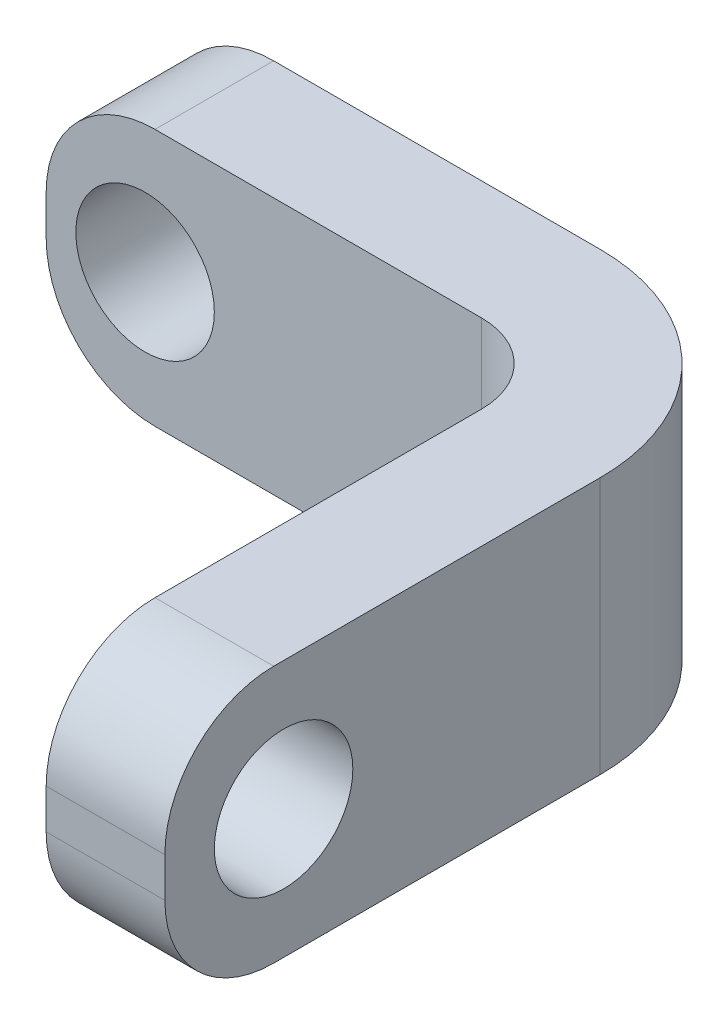
ISO-10303-21;
HEADER;
FILE_DESCRIPTION(('STEP AP214'),'2;1');
FILE_NAME('part.step','',(''),(''),'','','');
FILE_SCHEMA(('AUTOMOTIVE_DESIGN { 1 0 10303 214 1 1 1 1 }'));
ENDSEC;
DATA;
#1=APPLICATION_CONTEXT('core data for automotive mechanical design processes');
#2=APPLICATION_PROTOCOL_DEFINITION('international standard','automotive_design',2000,#1);
#3=PRODUCT_CONTEXT('',#1,'mechanical');
#4=PRODUCT('Part','Part','',(#3));
#5=PRODUCT_RELATED_PRODUCT_CATEGORY('part','',(#4));
#6=PRODUCT_DEFINITION_FORMATION('','',#4);
#7=PRODUCT_DEFINITION_CONTEXT('part definition',#1,'design');
#8=PRODUCT_DEFINITION('design','',#6,#7);
#9=PRODUCT_DEFINITION_SHAPE('','',#8);
#10=(LENGTH_UNIT() NAMED_UNIT(*) SI_UNIT(.MILLI.,.METRE.));
#11=(NAMED_UNIT(*) PLANE_ANGLE_UNIT() SI_UNIT($,.RADIAN.));
#12=(NAMED_UNIT(*) SI_UNIT($,.STERADIAN.) SOLID_ANGLE_UNIT());
#13=UNCERTAINTY_MEASURE_WITH_UNIT(LENGTH_MEASURE(1.E-05),#10,'distance_accuracy_value','');
#14=(GEOMETRIC_REPRESENTATION_CONTEXT(3) GLOBAL_UNCERTAINTY_ASSIGNED_CONTEXT((#13)) GLOBAL_UNIT_ASSIGNED_CONTEXT((#10,
#11,#12)) REPRESENTATION_CONTEXT('',''));
#15=CARTESIAN_POINT('',(0.,0.,0.));
#16=DIRECTION('',(0.,0.,1.));
#17=DIRECTION('',(1.,0.,0.));
#18=AXIS2_PLACEMENT_3D('',#15,#16,#17);
#19=CARTESIAN_POINT('',(-8.,0.,3.));
#20=DIRECTION('',(1.,0.,0.));
#21=DIRECTION('',(0.,0.,-1.));
#22=AXIS2_PLACEMENT_3D('',#19,#20,#21);
#23=PLANE('',#22);
#24=DIRECTION('',(0.,-1.,0.));
#25=VECTOR('',#24,1.);
#26=CARTESIAN_POINT('',(-8.,0.,0.));
#27=LINE('',#26,#25);
#28=CARTESIAN_POINT('',(-8.,0.5,0.));
#29=VERTEX_POINT('',#28);
#30=CARTESIAN_POINT('',(-8.,-0.5,0.));
#31=VERTEX_POINT('',#30);
#32=EDGE_CURVE('E244',#29,#31,#27,.T.);
#33=ORIENTED_EDGE('',*,*,#32,.T.);
#34=DIRECTION('',(0.,0.,-1.));
#35=VECTOR('',#34,1.);
#36=CARTESIAN_POINT('',(-8.,-0.5,3.));
#37=LINE('',#36,#35);
#38=CARTESIAN_POINT('',(-8.,-0.5,3.));
#39=VERTEX_POINT('',#38);
#40=EDGE_CURVE('E203',#31,#39,#37,.F.);
#41=ORIENTED_EDGE('',*,*,#40,.T.);
#42=DIRECTION('',(0.,-1.,0.));
#43=VECTOR('',#42,1.);
#44=CARTESIAN_POINT('',(-8.,0.,3.));
#45=LINE('',#44,#43);
#46=CARTESIAN_POINT('',(-8.,0.5,3.));
#47=VERTEX_POINT('',#46);
#48=EDGE_CURVE('E258',#47,#39,#45,.T.);
#49=ORIENTED_EDGE('',*,*,#48,.F.);
#50=DIRECTION('',(0.,0.,-1.));
#51=VECTOR('',#50,1.);
#52=CARTESIAN_POINT('',(-8.,0.5,0.));
#53=LINE('',#52,#51);
#54=EDGE_CURVE('E199',#47,#29,#53,.T.);
#55=ORIENTED_EDGE('',*,*,#54,.T.);
#56=EDGE_LOOP('',(#33,#41,#49,#55));
#57=FACE_BOUND('',#56,.T.);
#58=ADVANCED_FACE('F45',(#57),#23,.F.);
#59=CARTESIAN_POINT('',(0.,-3.25,3.));
#60=DIRECTION('',(0.,1.,0.));
#61=DIRECTION('',(-1.,0.,0.));
#62=AXIS2_PLACEMENT_3D('',#59,#60,#61);
#63=PLANE('',#62);
#64=DIRECTION('',(1.,0.,0.));
#65=VECTOR('',#64,1.);
#66=CARTESIAN_POINT('',(0.,-3.25,0.));
#67=LINE('',#66,#65);
#68=CARTESIAN_POINT('',(-5.25,-3.25,0.));
#69=VERTEX_POINT('',#68);
#70=CARTESIAN_POINT('',(3.,-3.25,0.));
#71=VERTEX_POINT('',#70);
#72=EDGE_CURVE('E236',#69,#71,#67,.T.);
#73=ORIENTED_EDGE('',*,*,#72,.T.);
#74=CARTESIAN_POINT('',(3.,-3.25,5.));
#75=DIRECTION('',(0.,1.,0.));
#76=DIRECTION('',(-1.,0.,0.));
#77=AXIS2_PLACEMENT_3D('',#74,#75,#76);
#78=CIRCLE('',#77,5.);
#79=CARTESIAN_POINT('',(8.,-3.25,5.));
#80=VERTEX_POINT('',#79);
#81=EDGE_CURVE('E68',#71,#80,#78,.F.);
#82=ORIENTED_EDGE('',*,*,#81,.T.);
#83=DIRECTION('',(0.,0.,-1.));
#84=VECTOR('',#83,1.);
#85=CARTESIAN_POINT('',(8.,-3.25,16.));
#86=LINE('',#85,#84);
#87=CARTESIAN_POINT('',(8.,-3.25,13.25));
#88=VERTEX_POINT('',#87);
#89=EDGE_CURVE('E275',#88,#80,#86,.T.);
#90=ORIENTED_EDGE('',*,*,#89,.F.);
#91=DIRECTION('',(1.,0.,0.));
#92=VECTOR('',#91,1.);
#93=CARTESIAN_POINT('',(5.,-3.25,13.25));
#94=LINE('',#93,#92);
#95=CARTESIAN_POINT('',(5.,-3.25,13.25));
#96=VERTEX_POINT('',#95);
#97=EDGE_CURVE('E179',#88,#96,#94,.F.);
#98=ORIENTED_EDGE('',*,*,#97,.T.);
#99=DIRECTION('',(0.,0.,-1.));
#100=VECTOR('',#99,1.);
#101=CARTESIAN_POINT('',(5.,-3.25,16.));
#102=LINE('',#101,#100);
#103=CARTESIAN_POINT('',(5.,-3.25,5.));
#104=VERTEX_POINT('',#103);
#105=EDGE_CURVE('E271',#96,#104,#102,.T.);
#106=ORIENTED_EDGE('',*,*,#105,.T.);
#107=CARTESIAN_POINT('',(3.,-3.25,5.));
#108=DIRECTION('',(0.,1.,0.));
#109=DIRECTION('',(-1.,0.,0.));
#110=AXIS2_PLACEMENT_3D('',#107,#108,#109);
#111=CIRCLE('',#110,2.);
#112=CARTESIAN_POINT('',(3.,-3.25,3.));
#113=VERTEX_POINT('',#112);
#114=EDGE_CURVE('E219',#104,#113,#111,.T.);
#115=ORIENTED_EDGE('',*,*,#114,.T.);
#116=DIRECTION('',(1.,0.,0.));
#117=VECTOR('',#116,1.);
#118=CARTESIAN_POINT('',(0.,-3.25,3.));
#119=LINE('',#118,#117);
#120=CARTESIAN_POINT('',(-5.25,-3.25,3.));
#121=VERTEX_POINT('',#120);
#122=EDGE_CURVE('E167',#121,#113,#119,.T.);
#123=ORIENTED_EDGE('',*,*,#122,.F.);
#124=DIRECTION('',(0.,0.,-1.));
#125=VECTOR('',#124,1.);
#126=CARTESIAN_POINT('',(-5.25,-3.25,3.));
#127=LINE('',#126,#125);
#128=EDGE_CURVE('E175',#121,#69,#127,.T.);
#129=ORIENTED_EDGE('',*,*,#128,.T.);
#130=EDGE_LOOP('',(#73,#82,#90,#98,#106,#115,#123,#129));
#131=FACE_BOUND('',#130,.T.);
#132=ADVANCED_FACE('F240',(#131),#63,.F.);
#133=CARTESIAN_POINT('',(-5.5,0.,3.));
#134=DIRECTION('',(0.,0.,-1.));
#135=DIRECTION('',(-1.,0.,0.));
#136=AXIS2_PLACEMENT_3D('',#133,#134,#135);
#137=CYLINDRICAL_SURFACE('',#136,1.75);
#138=CARTESIAN_POINT('',(-5.5,0.,3.));
#139=DIRECTION('',(0.,0.,1.));
#140=DIRECTION('',(1.,0.,0.));
#141=AXIS2_PLACEMENT_3D('',#138,#139,#140);
#142=CIRCLE('',#141,1.75);
#143=CARTESIAN_POINT('',(-3.75,0.,3.));
#144=VERTEX_POINT('',#143);
#145=EDGE_CURVE('E247',#144,#144,#142,.T.);
#146=ORIENTED_EDGE('',*,*,#145,.T.);
#147=EDGE_LOOP('',(#146));
#148=FACE_BOUND('',#147,.T.);
#149=CARTESIAN_POINT('',(-5.5,0.,0.));
#150=DIRECTION('',(0.,0.,1.));
#151=DIRECTION('',(1.,0.,0.));
#152=AXIS2_PLACEMENT_3D('',#149,#150,#151);
#153=CIRCLE('',#152,1.75);
#154=CARTESIAN_POINT('',(-3.75,0.,0.));
#155=VERTEX_POINT('',#154);
#156=EDGE_CURVE('E249',#155,#155,#153,.T.);
#157=ORIENTED_EDGE('',*,*,#156,.F.);
#158=EDGE_LOOP('',(#157));
#159=FACE_BOUND('',#158,.T.);
#160=ADVANCED_FACE('F308',(#148,#159),#137,.F.);
#161=CARTESIAN_POINT('',(0.,3.25,3.));
#162=DIRECTION('',(0.,1.,0.));
#163=DIRECTION('',(-1.,0.,0.));
#164=AXIS2_PLACEMENT_3D('',#161,#162,#163);
#165=PLANE('',#164);
#166=DIRECTION('',(0.,0.,-1.));
#167=VECTOR('',#166,1.);
#168=CARTESIAN_POINT('',(8.,3.25,16.));
#169=LINE('',#168,#167);
#170=CARTESIAN_POINT('',(8.,3.25,13.25));
#171=VERTEX_POINT('',#170);
#172=CARTESIAN_POINT('',(8.,3.25,5.));
#173=VERTEX_POINT('',#172);
#174=EDGE_CURVE('E137',#171,#173,#169,.T.);
#175=ORIENTED_EDGE('',*,*,#174,.T.);
#176=CARTESIAN_POINT('',(3.,3.25,5.));
#177=DIRECTION('',(0.,1.,0.));
#178=DIRECTION('',(-1.,0.,0.));
#179=AXIS2_PLACEMENT_3D('',#176,#177,#178);
#180=CIRCLE('',#179,5.);
#181=CARTESIAN_POINT('',(3.,3.25,0.));
#182=VERTEX_POINT('',#181);
#183=EDGE_CURVE('E11',#173,#182,#180,.T.);
#184=ORIENTED_EDGE('',*,*,#183,.T.);
#185=DIRECTION('',(1.,0.,0.));
#186=VECTOR('',#185,1.);
#187=CARTESIAN_POINT('',(0.,3.25,0.));
#188=LINE('',#187,#186);
#189=CARTESIAN_POINT('',(-5.25,3.25,0.));
#190=VERTEX_POINT('',#189);
#191=EDGE_CURVE('E170',#190,#182,#188,.T.);
#192=ORIENTED_EDGE('',*,*,#191,.F.);
#193=DIRECTION('',(0.,0.,-1.));
#194=VECTOR('',#193,1.);
#195=CARTESIAN_POINT('',(-5.25,3.25,3.));
#196=LINE('',#195,#194);
#197=CARTESIAN_POINT('',(-5.25,3.25,3.));
#198=VERTEX_POINT('',#197);
#199=EDGE_CURVE('E187',#190,#198,#196,.F.);
#200=ORIENTED_EDGE('',*,*,#199,.T.);
#201=DIRECTION('',(1.,0.,0.));
#202=VECTOR('',#201,1.);
#203=CARTESIAN_POINT('',(0.,3.25,3.));
#204=LINE('',#203,#202);
#205=CARTESIAN_POINT('',(3.,3.25,3.));
#206=VERTEX_POINT('',#205);
#207=EDGE_CURVE('E161',#198,#206,#204,.T.);
#208=ORIENTED_EDGE('',*,*,#207,.T.);
#209=CARTESIAN_POINT('',(3.,3.25,5.));
#210=DIRECTION('',(0.,1.,0.));
#211=DIRECTION('',(-1.,0.,0.));
#212=AXIS2_PLACEMENT_3D('',#209,#210,#211);
#213=CIRCLE('',#212,2.);
#214=CARTESIAN_POINT('',(5.,3.25,5.));
#215=VERTEX_POINT('',#214);
#216=EDGE_CURVE('E222',#206,#215,#213,.F.);
#217=ORIENTED_EDGE('',*,*,#216,.T.);
#218=DIRECTION('',(0.,0.,-1.));
#219=VECTOR('',#218,1.);
#220=CARTESIAN_POINT('',(5.,3.25,16.));
#221=LINE('',#220,#219);
#222=CARTESIAN_POINT('',(5.,3.25,13.25));
#223=VERTEX_POINT('',#222);
#224=EDGE_CURVE('E267',#223,#215,#221,.T.);
#225=ORIENTED_EDGE('',*,*,#224,.F.);
#226=DIRECTION('',(1.,0.,0.));
#227=VECTOR('',#226,1.);
#228=CARTESIAN_POINT('',(0.,3.25,13.25));
#229=LINE('',#228,#227);
#230=EDGE_CURVE('E190',#223,#171,#229,.T.);
#231=ORIENTED_EDGE('',*,*,#230,.T.);
#232=EDGE_LOOP('',(#175,#184,#192,#200,#208,#217,#225,#231));
#233=FACE_BOUND('',#232,.T.);
#234=ADVANCED_FACE('F314',(#233),#165,.T.);
#235=CARTESIAN_POINT('',(0.,0.,3.));
#236=DIRECTION('',(0.,0.,1.));
#237=DIRECTION('',(1.,0.,0.));
#238=AXIS2_PLACEMENT_3D('',#235,#236,#237);
#239=PLANE('',#238);
#240=ORIENTED_EDGE('',*,*,#145,.F.);
#241=EDGE_LOOP('',(#240));
#242=FACE_BOUND('',#241,.T.);
#243=ORIENTED_EDGE('',*,*,#122,.T.);
#244=DIRECTION('',(0.,-1.,0.));
#245=VECTOR('',#244,1.);
#246=CARTESIAN_POINT('',(3.,0.,3.));
#247=LINE('',#246,#245);
#248=EDGE_CURVE('E216',#113,#206,#247,.F.);
#249=ORIENTED_EDGE('',*,*,#248,.T.);
#250=ORIENTED_EDGE('',*,*,#207,.F.);
#251=CARTESIAN_POINT('',(-5.25,0.5,3.));
#252=DIRECTION('',(0.,0.,1.));
#253=DIRECTION('',(1.,0.,0.));
#254=AXIS2_PLACEMENT_3D('',#251,#252,#253);
#255=CIRCLE('',#254,2.75);
#256=EDGE_CURVE('E206',#198,#47,#255,.T.);
#257=ORIENTED_EDGE('',*,*,#256,.T.);
#258=ORIENTED_EDGE('',*,*,#48,.T.);
#259=CARTESIAN_POINT('',(-5.25,-0.5,3.));
#260=DIRECTION('',(0.,0.,1.));
#261=DIRECTION('',(1.,0.,0.));
#262=AXIS2_PLACEMENT_3D('',#259,#260,#261);
#263=CIRCLE('',#262,2.75);
#264=EDGE_CURVE('E209',#39,#121,#263,.T.);
#265=ORIENTED_EDGE('',*,*,#264,.T.);
#266=EDGE_LOOP('',(#243,#249,#250,#257,#258,#265));
#267=FACE_BOUND('',#266,.T.);
#268=ADVANCED_FACE('F346',(#242,#267),#239,.T.);
#269=CARTESIAN_POINT('',(0.,0.,0.));
#270=DIRECTION('',(0.,0.,1.));
#271=DIRECTION('',(1.,0.,0.));
#272=AXIS2_PLACEMENT_3D('',#269,#270,#271);
#273=PLANE('',#272);
#274=ORIENTED_EDGE('',*,*,#156,.T.);
#275=EDGE_LOOP('',(#274));
#276=FACE_BOUND('',#275,.T.);
#277=ORIENTED_EDGE('',*,*,#191,.T.);
#278=DIRECTION('',(0.,-1.,0.));
#279=VECTOR('',#278,1.);
#280=CARTESIAN_POINT('',(3.,-3.25,0.));
#281=LINE('',#280,#279);
#282=EDGE_CURVE('E225',#182,#71,#281,.T.);
#283=ORIENTED_EDGE('',*,*,#282,.T.);
#284=ORIENTED_EDGE('',*,*,#72,.F.);
#285=CARTESIAN_POINT('',(-5.25,-0.5,0.));
#286=DIRECTION('',(0.,0.,1.));
#287=DIRECTION('',(1.,0.,0.));
#288=AXIS2_PLACEMENT_3D('',#285,#286,#287);
#289=CIRCLE('',#288,2.75);
#290=EDGE_CURVE('E196',#69,#31,#289,.F.);
#291=ORIENTED_EDGE('',*,*,#290,.T.);
#292=ORIENTED_EDGE('',*,*,#32,.F.);
#293=CARTESIAN_POINT('',(-5.25,0.5,0.));
#294=DIRECTION('',(0.,0.,1.));
#295=DIRECTION('',(1.,0.,0.));
#296=AXIS2_PLACEMENT_3D('',#293,#294,#295);
#297=CIRCLE('',#296,2.75);
#298=EDGE_CURVE('E193',#29,#190,#297,.F.);
#299=ORIENTED_EDGE('',*,*,#298,.T.);
#300=EDGE_LOOP('',(#277,#283,#284,#291,#292,#299));
#301=FACE_BOUND('',#300,.T.);
#302=ADVANCED_FACE('F235',(#276,#301),#273,.F.);
#303=CARTESIAN_POINT('',(5.,0.,16.));
#304=DIRECTION('',(1.,0.,0.));
#305=DIRECTION('',(0.,0.,-1.));
#306=AXIS2_PLACEMENT_3D('',#303,#304,#305);
#307=PLANE('',#306);
#308=CARTESIAN_POINT('',(5.,0.,13.));
#309=DIRECTION('',(1.,0.,0.));
#310=DIRECTION('',(0.,0.,-1.));
#311=AXIS2_PLACEMENT_3D('',#308,#309,#310);
#312=CIRCLE('',#311,1.75);
#313=CARTESIAN_POINT('',(5.,0.,11.25));
#314=VERTEX_POINT('',#313);
#315=EDGE_CURVE('E155',#314,#314,#312,.F.);
#316=ORIENTED_EDGE('',*,*,#315,.F.);
#317=EDGE_LOOP('',(#316));
#318=FACE_BOUND('',#317,.T.);
#319=ORIENTED_EDGE('',*,*,#224,.T.);
#320=DIRECTION('',(0.,-1.,0.));
#321=VECTOR('',#320,1.);
#322=CARTESIAN_POINT('',(5.,0.,5.));
#323=LINE('',#322,#321);
#324=EDGE_CURVE('E212',#215,#104,#323,.T.);
#325=ORIENTED_EDGE('',*,*,#324,.T.);
#326=ORIENTED_EDGE('',*,*,#105,.F.);
#327=CARTESIAN_POINT('',(5.,-0.499999999999999,13.25));
#328=DIRECTION('',(1.,0.,0.));
#329=DIRECTION('',(0.,0.,-1.));
#330=AXIS2_PLACEMENT_3D('',#327,#328,#329);
#331=CIRCLE('',#330,2.75);
#332=CARTESIAN_POINT('',(5.,-0.499999999999999,16.));
#333=VERTEX_POINT('',#332);
#334=EDGE_CURVE('E184',#96,#333,#331,.F.);
#335=ORIENTED_EDGE('',*,*,#334,.T.);
#336=DIRECTION('',(0.,-1.,0.));
#337=VECTOR('',#336,1.);
#338=CARTESIAN_POINT('',(5.,0.,16.));
#339=LINE('',#338,#337);
#340=CARTESIAN_POINT('',(5.,0.499999999999999,16.));
#341=VERTEX_POINT('',#340);
#342=EDGE_CURVE('E154',#341,#333,#339,.T.);
#343=ORIENTED_EDGE('',*,*,#342,.F.);
#344=CARTESIAN_POINT('',(5.,0.499999999999999,13.25));
#345=DIRECTION('',(1.,0.,0.));
#346=DIRECTION('',(0.,0.,-1.));
#347=AXIS2_PLACEMENT_3D('',#344,#345,#346);
#348=CIRCLE('',#347,2.75);
#349=EDGE_CURVE('E159',#341,#223,#348,.F.);
#350=ORIENTED_EDGE('',*,*,#349,.T.);
#351=EDGE_LOOP('',(#319,#325,#326,#335,#343,#350));
#352=FACE_BOUND('',#351,.T.);
#353=ADVANCED_FACE('F292',(#318,#352),#307,.F.);
#354=CARTESIAN_POINT('',(8.,0.,16.));
#355=DIRECTION('',(1.,0.,0.));
#356=DIRECTION('',(0.,0.,-1.));
#357=AXIS2_PLACEMENT_3D('',#354,#355,#356);
#358=PLANE('',#357);
#359=CARTESIAN_POINT('',(8.,0.,13.));
#360=DIRECTION('',(1.,0.,0.));
#361=DIRECTION('',(0.,0.,-1.));
#362=AXIS2_PLACEMENT_3D('',#359,#360,#361);
#363=CIRCLE('',#362,1.75);
#364=CARTESIAN_POINT('',(8.,0.,11.25));
#365=VERTEX_POINT('',#364);
#366=EDGE_CURVE('E283',#365,#365,#363,.T.);
#367=ORIENTED_EDGE('',*,*,#366,.F.);
#368=EDGE_LOOP('',(#367));
#369=FACE_BOUND('',#368,.T.);
#370=ORIENTED_EDGE('',*,*,#89,.T.);
#371=DIRECTION('',(0.,-1.,0.));
#372=VECTOR('',#371,1.);
#373=CARTESIAN_POINT('',(8.,3.25,5.));
#374=LINE('',#373,#372);
#375=EDGE_CURVE('E54',#80,#173,#374,.F.);
#376=ORIENTED_EDGE('',*,*,#375,.T.);
#377=ORIENTED_EDGE('',*,*,#174,.F.);
#378=CARTESIAN_POINT('',(8.,0.499999999999999,13.25));
#379=DIRECTION('',(1.,0.,0.));
#380=DIRECTION('',(0.,0.,-1.));
#381=AXIS2_PLACEMENT_3D('',#378,#379,#380);
#382=CIRCLE('',#381,2.75);
#383=CARTESIAN_POINT('',(8.,0.499999999999999,16.));
#384=VERTEX_POINT('',#383);
#385=EDGE_CURVE('E133',#171,#384,#382,.T.);
#386=ORIENTED_EDGE('',*,*,#385,.T.);
#387=DIRECTION('',(0.,-1.,0.));
#388=VECTOR('',#387,1.);
#389=CARTESIAN_POINT('',(8.,0.,16.));
#390=LINE('',#389,#388);
#391=CARTESIAN_POINT('',(8.,-0.499999999999999,16.));
#392=VERTEX_POINT('',#391);
#393=EDGE_CURVE('E136',#384,#392,#390,.T.);
#394=ORIENTED_EDGE('',*,*,#393,.T.);
#395=CARTESIAN_POINT('',(8.,-0.499999999999999,13.25));
#396=DIRECTION('',(1.,0.,0.));
#397=DIRECTION('',(0.,0.,-1.));
#398=AXIS2_PLACEMENT_3D('',#395,#396,#397);
#399=CIRCLE('',#398,2.75);
#400=EDGE_CURVE('E143',#392,#88,#399,.T.);
#401=ORIENTED_EDGE('',*,*,#400,.T.);
#402=EDGE_LOOP('',(#370,#376,#377,#386,#394,#401));
#403=FACE_BOUND('',#402,.T.);
#404=ADVANCED_FACE('F135',(#369,#403),#358,.T.);
#405=CARTESIAN_POINT('',(0.,0.,16.));
#406=DIRECTION('',(0.,0.,1.));
#407=DIRECTION('',(1.,0.,0.));
#408=AXIS2_PLACEMENT_3D('',#405,#406,#407);
#409=PLANE('',#408);
#410=ORIENTED_EDGE('',*,*,#342,.T.);
#411=DIRECTION('',(1.,0.,0.));
#412=VECTOR('',#411,1.);
#413=CARTESIAN_POINT('',(8.,-0.499999999999999,16.));
#414=LINE('',#413,#412);
#415=EDGE_CURVE('E144',#333,#392,#414,.T.);
#416=ORIENTED_EDGE('',*,*,#415,.T.);
#417=ORIENTED_EDGE('',*,*,#393,.F.);
#418=DIRECTION('',(1.,0.,0.));
#419=VECTOR('',#418,1.);
#420=CARTESIAN_POINT('',(0.,0.5,16.));
#421=LINE('',#420,#419);
#422=EDGE_CURVE('E150',#384,#341,#421,.F.);
#423=ORIENTED_EDGE('',*,*,#422,.T.);
#424=EDGE_LOOP('',(#410,#416,#417,#423));
#425=FACE_BOUND('',#424,.T.);
#426=ADVANCED_FACE('F149',(#425),#409,.T.);
#427=CARTESIAN_POINT('',(-8.001,0.,13.));
#428=DIRECTION('',(1.,0.,0.));
#429=DIRECTION('',(0.,0.,-1.));
#430=AXIS2_PLACEMENT_3D('',#427,#428,#429);
#431=CYLINDRICAL_SURFACE('',#430,1.75);
#432=ORIENTED_EDGE('',*,*,#366,.T.);
#433=EDGE_LOOP('',(#432));
#434=FACE_BOUND('',#433,.T.);
#435=ORIENTED_EDGE('',*,*,#315,.T.);
#436=EDGE_LOOP('',(#435));
#437=FACE_BOUND('',#436,.T.);
#438=ADVANCED_FACE('F288',(#434,#437),#431,.F.);
#439=CARTESIAN_POINT('',(0.,-0.5,13.25));
#440=DIRECTION('',(-1.,0.,0.));
#441=DIRECTION('',(0.,-1.,0.));
#442=AXIS2_PLACEMENT_3D('',#439,#440,#441);
#443=CYLINDRICAL_SURFACE('',#442,2.75);
#444=ORIENTED_EDGE('',*,*,#334,.F.);
#445=ORIENTED_EDGE('',*,*,#97,.F.);
#446=ORIENTED_EDGE('',*,*,#400,.F.);
#447=ORIENTED_EDGE('',*,*,#415,.F.);
#448=EDGE_LOOP('',(#444,#445,#446,#447));
#449=FACE_BOUND('',#448,.T.);
#450=ADVANCED_FACE('F316',(#449),#443,.T.);
#451=CARTESIAN_POINT('',(0.,0.5,13.25));
#452=DIRECTION('',(1.,0.,0.));
#453=DIRECTION('',(0.,1.,0.));
#454=AXIS2_PLACEMENT_3D('',#451,#452,#453);
#455=CYLINDRICAL_SURFACE('',#454,2.75);
#456=ORIENTED_EDGE('',*,*,#349,.F.);
#457=ORIENTED_EDGE('',*,*,#422,.F.);
#458=ORIENTED_EDGE('',*,*,#385,.F.);
#459=ORIENTED_EDGE('',*,*,#230,.F.);
#460=EDGE_LOOP('',(#456,#457,#458,#459));
#461=FACE_BOUND('',#460,.T.);
#462=ADVANCED_FACE('F158',(#461),#455,.T.);
#463=CARTESIAN_POINT('',(-5.25,-0.5,3.));
#464=DIRECTION('',(0.,0.,-1.));
#465=DIRECTION('',(-1.,0.,0.));
#466=AXIS2_PLACEMENT_3D('',#463,#464,#465);
#467=CYLINDRICAL_SURFACE('',#466,2.75);
#468=ORIENTED_EDGE('',*,*,#264,.F.);
#469=ORIENTED_EDGE('',*,*,#40,.F.);
#470=ORIENTED_EDGE('',*,*,#290,.F.);
#471=ORIENTED_EDGE('',*,*,#128,.F.);
#472=EDGE_LOOP('',(#468,#469,#470,#471));
#473=FACE_BOUND('',#472,.T.);
#474=ADVANCED_FACE('F322',(#473),#467,.T.);
#475=CARTESIAN_POINT('',(-5.25,0.5,3.));
#476=DIRECTION('',(0.,0.,1.));
#477=DIRECTION('',(1.,0.,0.));
#478=AXIS2_PLACEMENT_3D('',#475,#476,#477);
#479=CYLINDRICAL_SURFACE('',#478,2.75);
#480=ORIENTED_EDGE('',*,*,#256,.F.);
#481=ORIENTED_EDGE('',*,*,#199,.F.);
#482=ORIENTED_EDGE('',*,*,#298,.F.);
#483=ORIENTED_EDGE('',*,*,#54,.F.);
#484=EDGE_LOOP('',(#480,#481,#482,#483));
#485=FACE_BOUND('',#484,.T.);
#486=ADVANCED_FACE('F325',(#485),#479,.T.);
#487=CARTESIAN_POINT('',(3.,0.,5.));
#488=DIRECTION('',(0.,-1.,0.));
#489=DIRECTION('',(0.,0.,-1.));
#490=AXIS2_PLACEMENT_3D('',#487,#488,#489);
#491=CYLINDRICAL_SURFACE('',#490,2.);
#492=ORIENTED_EDGE('',*,*,#216,.F.);
#493=ORIENTED_EDGE('',*,*,#248,.F.);
#494=ORIENTED_EDGE('',*,*,#114,.F.);
#495=ORIENTED_EDGE('',*,*,#324,.F.);
#496=EDGE_LOOP('',(#492,#493,#494,#495));
#497=FACE_BOUND('',#496,.T.);
#498=ADVANCED_FACE('F328',(#497),#491,.F.);
#499=CARTESIAN_POINT('',(3.,0.,5.));
#500=DIRECTION('',(0.,1.,0.));
#501=DIRECTION('',(0.,0.,1.));
#502=AXIS2_PLACEMENT_3D('',#499,#500,#501);
#503=CYLINDRICAL_SURFACE('',#502,5.);
#504=ORIENTED_EDGE('',*,*,#183,.F.);
#505=ORIENTED_EDGE('',*,*,#375,.F.);
#506=ORIENTED_EDGE('',*,*,#81,.F.);
#507=ORIENTED_EDGE('',*,*,#282,.F.);
#508=EDGE_LOOP('',(#504,#505,#506,#507));
#509=FACE_BOUND('',#508,.T.);
#510=ADVANCED_FACE('F47',(#509),#503,.T.);
#511=CLOSED_SHELL('',(#58,#132,#160,#234,#268,#302,#353,#404,#426,#438,#450,#462,#474,#486,#498,#510));
#512=MANIFOLD_SOLID_BREP('B2',#511);
#513=ADVANCED_BREP_SHAPE_REPRESENTATION('',(#18,#512),#14);
#514=SHAPE_DEFINITION_REPRESENTATION(#9,#513);
ENDSEC;
END-ISO-10303-21;
